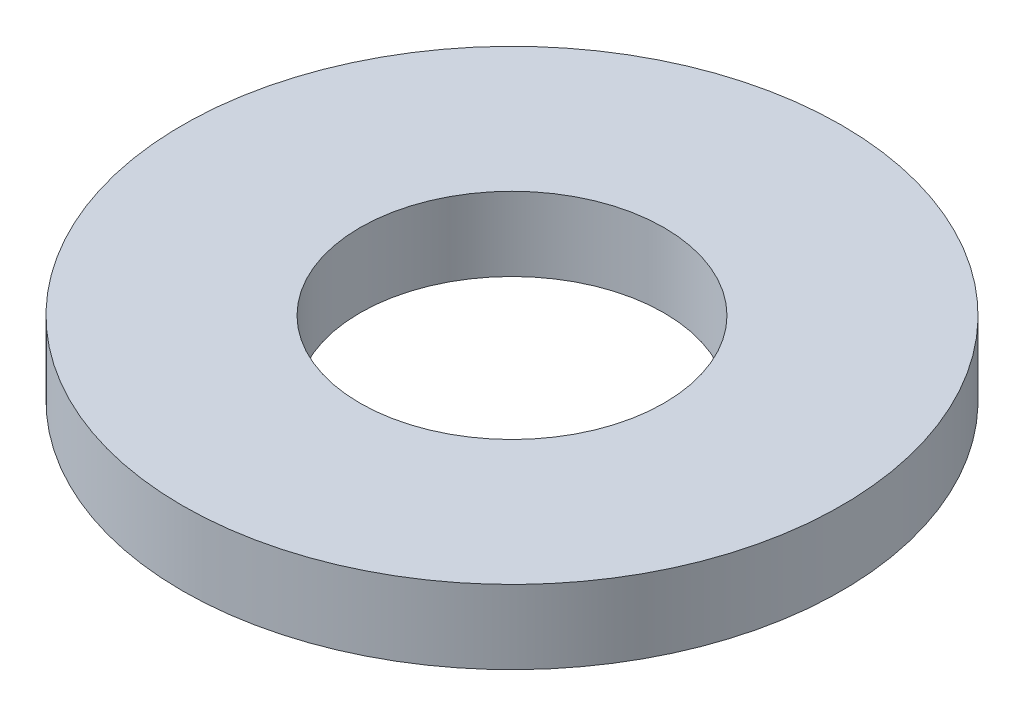
ISO-10303-21;
HEADER;
FILE_DESCRIPTION(('STEP AP214'),'2;1');
FILE_NAME('part.step','',(''),(''),'','','');
FILE_SCHEMA(('AUTOMOTIVE_DESIGN { 1 0 10303 214 1 1 1 1 }'));
ENDSEC;
DATA;
#1=APPLICATION_CONTEXT('core data for automotive mechanical design processes');
#2=APPLICATION_PROTOCOL_DEFINITION('international standard','automotive_design',2000,#1);
#3=PRODUCT_CONTEXT('',#1,'mechanical');
#4=PRODUCT('Part','Part','',(#3));
#5=PRODUCT_RELATED_PRODUCT_CATEGORY('part','',(#4));
#6=PRODUCT_DEFINITION_FORMATION('','',#4);
#7=PRODUCT_DEFINITION_CONTEXT('part definition',#1,'design');
#8=PRODUCT_DEFINITION('design','',#6,#7);
#9=PRODUCT_DEFINITION_SHAPE('','',#8);
#10=(LENGTH_UNIT() NAMED_UNIT(*) SI_UNIT(.MILLI.,.METRE.));
#11=(NAMED_UNIT(*) PLANE_ANGLE_UNIT() SI_UNIT($,.RADIAN.));
#12=(NAMED_UNIT(*) SI_UNIT($,.STERADIAN.) SOLID_ANGLE_UNIT());
#13=UNCERTAINTY_MEASURE_WITH_UNIT(LENGTH_MEASURE(1.E-05),#10,'distance_accuracy_value','');
#14=(GEOMETRIC_REPRESENTATION_CONTEXT(3) GLOBAL_UNCERTAINTY_ASSIGNED_CONTEXT((#13)) GLOBAL_UNIT_ASSIGNED_CONTEXT((#10,
#11,#12)) REPRESENTATION_CONTEXT('',''));
#15=CARTESIAN_POINT('',(0.,0.,0.));
#16=DIRECTION('',(0.,0.,1.));
#17=DIRECTION('',(1.,0.,0.));
#18=AXIS2_PLACEMENT_3D('',#15,#16,#17);
#19=CARTESIAN_POINT('',(0.,0.,0.));
#20=DIRECTION('',(0.,1.,0.));
#21=DIRECTION('',(0.,0.,1.));
#22=AXIS2_PLACEMENT_3D('',#19,#20,#21);
#23=PLANE('',#22);
#24=CARTESIAN_POINT('',(0.,0.,0.));
#25=DIRECTION('',(0.,-1.,0.));
#26=DIRECTION('',(0.,0.,-1.));
#27=AXIS2_PLACEMENT_3D('',#24,#25,#26);
#28=CIRCLE('',#27,2.1971);
#29=CARTESIAN_POINT('',(0.,0.,-2.1971));
#30=VERTEX_POINT('',#29);
#31=EDGE_CURVE('E26',#30,#30,#28,.F.);
#32=ORIENTED_EDGE('',*,*,#31,.T.);
#33=EDGE_LOOP('',(#32));
#34=FACE_BOUND('',#33,.T.);
#35=CARTESIAN_POINT('',(0.,0.,0.));
#36=DIRECTION('',(0.,-1.,0.));
#37=DIRECTION('',(0.,0.,-1.));
#38=AXIS2_PLACEMENT_3D('',#35,#36,#37);
#39=CIRCLE('',#38,4.7625);
#40=CARTESIAN_POINT('',(0.,0.,-4.7625));
#41=VERTEX_POINT('',#40);
#42=EDGE_CURVE('E17',#41,#41,#39,.F.);
#43=ORIENTED_EDGE('',*,*,#42,.F.);
#44=EDGE_LOOP('',(#43));
#45=FACE_BOUND('',#44,.T.);
#46=ADVANCED_FACE('F14',(#34,#45),#23,.F.);
#47=CARTESIAN_POINT('',(0.,1.0668,0.));
#48=DIRECTION('',(0.,-1.,0.));
#49=DIRECTION('',(0.,0.,-1.));
#50=AXIS2_PLACEMENT_3D('',#47,#48,#49);
#51=CYLINDRICAL_SURFACE('',#50,4.7625);
#52=ORIENTED_EDGE('',*,*,#42,.T.);
#53=EDGE_LOOP('',(#52));
#54=FACE_BOUND('',#53,.T.);
#55=CARTESIAN_POINT('',(0.,1.0668,0.));
#56=DIRECTION('',(0.,-1.,0.));
#57=DIRECTION('',(0.,0.,-1.));
#58=AXIS2_PLACEMENT_3D('',#55,#56,#57);
#59=CIRCLE('',#58,4.7625);
#60=CARTESIAN_POINT('',(0.,1.0668,-4.7625));
#61=VERTEX_POINT('',#60);
#62=EDGE_CURVE('E21',#61,#61,#59,.F.);
#63=ORIENTED_EDGE('',*,*,#62,.F.);
#64=EDGE_LOOP('',(#63));
#65=FACE_BOUND('',#64,.T.);
#66=ADVANCED_FACE('F34',(#54,#65),#51,.T.);
#67=CARTESIAN_POINT('',(0.,1.0668,0.));
#68=DIRECTION('',(0.,-1.,0.));
#69=DIRECTION('',(0.,0.,-1.));
#70=AXIS2_PLACEMENT_3D('',#67,#68,#69);
#71=CYLINDRICAL_SURFACE('',#70,2.1971);
#72=CARTESIAN_POINT('',(0.,1.0668,0.));
#73=DIRECTION('',(0.,-1.,0.));
#74=DIRECTION('',(0.,0.,-1.));
#75=AXIS2_PLACEMENT_3D('',#72,#73,#74);
#76=CIRCLE('',#75,2.1971);
#77=CARTESIAN_POINT('',(0.,1.0668,-2.1971));
#78=VERTEX_POINT('',#77);
#79=EDGE_CURVE('E10',#78,#78,#76,.T.);
#80=ORIENTED_EDGE('',*,*,#79,.F.);
#81=EDGE_LOOP('',(#80));
#82=FACE_BOUND('',#81,.T.);
#83=ORIENTED_EDGE('',*,*,#31,.F.);
#84=EDGE_LOOP('',(#83));
#85=FACE_BOUND('',#84,.T.);
#86=ADVANCED_FACE('F42',(#82,#85),#71,.F.);
#87=CARTESIAN_POINT('',(0.,1.0668,0.));
#88=DIRECTION('',(0.,1.,0.));
#89=DIRECTION('',(0.,0.,1.));
#90=AXIS2_PLACEMENT_3D('',#87,#88,#89);
#91=PLANE('',#90);
#92=ORIENTED_EDGE('',*,*,#79,.T.);
#93=EDGE_LOOP('',(#92));
#94=FACE_BOUND('',#93,.T.);
#95=ORIENTED_EDGE('',*,*,#62,.T.);
#96=EDGE_LOOP('',(#95));
#97=FACE_BOUND('',#96,.T.);
#98=ADVANCED_FACE('F43',(#94,#97),#91,.T.);
#99=CLOSED_SHELL('',(#46,#66,#86,#98));
#100=MANIFOLD_SOLID_BREP('B1',#99);
#101=ADVANCED_BREP_SHAPE_REPRESENTATION('',(#18,#100),#14);
#102=SHAPE_DEFINITION_REPRESENTATION(#9,#101);
ENDSEC;
END-ISO-10303-21;
